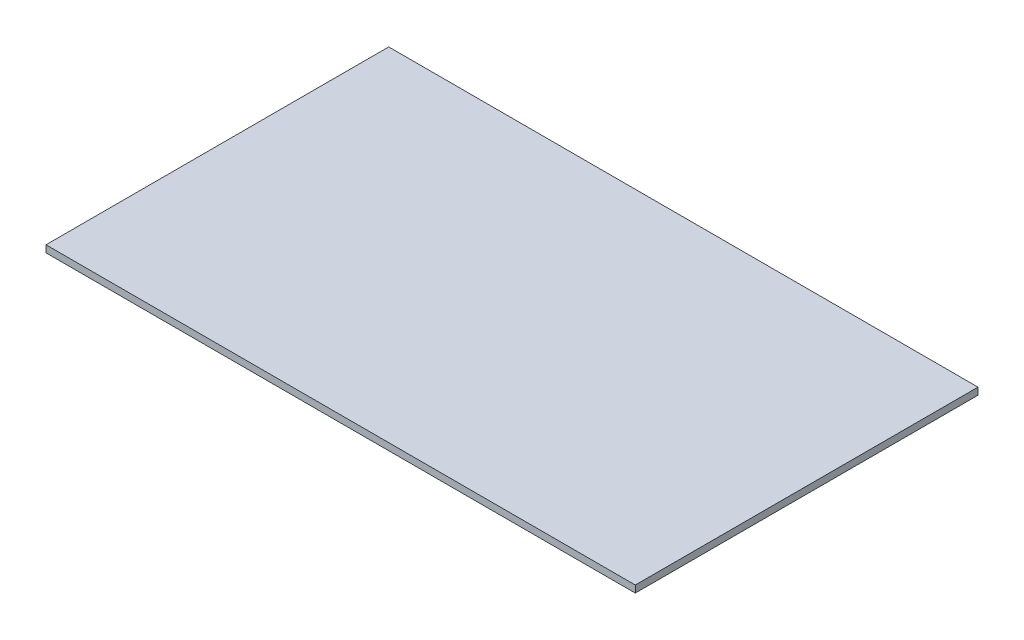
ISO-10303-21;
HEADER;
FILE_DESCRIPTION(('STEP AP214'),'2;1');
FILE_NAME('part.step','',(''),(''),'','','');
FILE_SCHEMA(('AUTOMOTIVE_DESIGN { 1 0 10303 214 1 1 1 1 }'));
ENDSEC;
DATA;
#1=APPLICATION_CONTEXT('core data for automotive mechanical design processes');
#2=APPLICATION_PROTOCOL_DEFINITION('international standard','automotive_design',2000,#1);
#3=PRODUCT_CONTEXT('',#1,'mechanical');
#4=PRODUCT('Part','Part','',(#3));
#5=PRODUCT_RELATED_PRODUCT_CATEGORY('part','',(#4));
#6=PRODUCT_DEFINITION_FORMATION('','',#4);
#7=PRODUCT_DEFINITION_CONTEXT('part definition',#1,'design');
#8=PRODUCT_DEFINITION('design','',#6,#7);
#9=PRODUCT_DEFINITION_SHAPE('','',#8);
#10=(LENGTH_UNIT() NAMED_UNIT(*) SI_UNIT(.MILLI.,.METRE.));
#11=(NAMED_UNIT(*) PLANE_ANGLE_UNIT() SI_UNIT($,.RADIAN.));
#12=(NAMED_UNIT(*) SI_UNIT($,.STERADIAN.) SOLID_ANGLE_UNIT());
#13=UNCERTAINTY_MEASURE_WITH_UNIT(LENGTH_MEASURE(1.E-05),#10,'distance_accuracy_value','');
#14=(GEOMETRIC_REPRESENTATION_CONTEXT(3) GLOBAL_UNCERTAINTY_ASSIGNED_CONTEXT((#13)) GLOBAL_UNIT_ASSIGNED_CONTEXT((#10,
#11,#12)) REPRESENTATION_CONTEXT('',''));
#15=CARTESIAN_POINT('',(0.,0.,0.));
#16=DIRECTION('',(0.,0.,1.));
#17=DIRECTION('',(1.,0.,0.));
#18=AXIS2_PLACEMENT_3D('',#15,#16,#17);
#19=CARTESIAN_POINT('',(-146.312791178337,3.,73.5829634934783));
#20=DIRECTION('',(1.,0.,0.));
#21=DIRECTION('',(0.,0.,-1.));
#22=AXIS2_PLACEMENT_3D('',#19,#20,#21);
#23=PLANE('',#22);
#24=DIRECTION('',(0.,0.,1.));
#25=VECTOR('',#24,1.);
#26=CARTESIAN_POINT('',(-146.312791178337,0.,73.5829634934783));
#27=LINE('',#26,#25);
#28=CARTESIAN_POINT('',(-146.312791178337,0.,-73.1563955891683));
#29=VERTEX_POINT('',#28);
#30=CARTESIAN_POINT('',(-146.312791178337,0.,73.5829634934783));
#31=VERTEX_POINT('',#30);
#32=EDGE_CURVE('E95',#29,#31,#27,.T.);
#33=ORIENTED_EDGE('',*,*,#32,.T.);
#34=DIRECTION('',(0.,-1.,0.));
#35=VECTOR('',#34,1.);
#36=CARTESIAN_POINT('',(-146.312791178337,3.,73.5829634934783));
#37=LINE('',#36,#35);
#38=CARTESIAN_POINT('',(-146.312791178337,3.,73.5829634934783));
#39=VERTEX_POINT('',#38);
#40=EDGE_CURVE('E11',#39,#31,#37,.T.);
#41=ORIENTED_EDGE('',*,*,#40,.F.);
#42=DIRECTION('',(0.,0.,1.));
#43=VECTOR('',#42,1.);
#44=CARTESIAN_POINT('',(-146.312791178337,3.,73.5829634934783));
#45=LINE('',#44,#43);
#46=CARTESIAN_POINT('',(-146.312791178337,3.,-73.1563955891683));
#47=VERTEX_POINT('',#46);
#48=EDGE_CURVE('E83',#47,#39,#45,.T.);
#49=ORIENTED_EDGE('',*,*,#48,.F.);
#50=DIRECTION('',(0.,-1.,0.));
#51=VECTOR('',#50,1.);
#52=CARTESIAN_POINT('',(-146.312791178337,3.,-73.1563955891683));
#53=LINE('',#52,#51);
#54=EDGE_CURVE('E91',#47,#29,#53,.T.);
#55=ORIENTED_EDGE('',*,*,#54,.T.);
#56=EDGE_LOOP('',(#33,#41,#49,#55));
#57=FACE_BOUND('',#56,.T.);
#58=ADVANCED_FACE('F32',(#57),#23,.F.);
#59=CARTESIAN_POINT('',(-146.312791178337,3.,73.5829634934783));
#60=DIRECTION('',(0.,0.,-1.));
#61=DIRECTION('',(-1.,0.,0.));
#62=AXIS2_PLACEMENT_3D('',#59,#60,#61);
#63=PLANE('',#62);
#64=DIRECTION('',(1.,0.,0.));
#65=VECTOR('',#64,1.);
#66=CARTESIAN_POINT('',(-146.312791178337,0.,73.5829634934783));
#67=LINE('',#66,#65);
#68=CARTESIAN_POINT('',(106.00212422104,0.,73.5829634934783));
#69=VERTEX_POINT('',#68);
#70=EDGE_CURVE('E87',#31,#69,#67,.T.);
#71=ORIENTED_EDGE('',*,*,#70,.T.);
#72=DIRECTION('',(0.,-1.,0.));
#73=VECTOR('',#72,1.);
#74=CARTESIAN_POINT('',(106.00212422104,3.,73.5829634934783));
#75=LINE('',#74,#73);
#76=CARTESIAN_POINT('',(106.00212422104,3.,73.5829634934783));
#77=VERTEX_POINT('',#76);
#78=EDGE_CURVE('E40',#77,#69,#75,.T.);
#79=ORIENTED_EDGE('',*,*,#78,.F.);
#80=DIRECTION('',(1.,0.,0.));
#81=VECTOR('',#80,1.);
#82=CARTESIAN_POINT('',(-146.312791178337,3.,73.5829634934783));
#83=LINE('',#82,#81);
#84=EDGE_CURVE('E78',#39,#77,#83,.T.);
#85=ORIENTED_EDGE('',*,*,#84,.F.);
#86=ORIENTED_EDGE('',*,*,#40,.T.);
#87=EDGE_LOOP('',(#71,#79,#85,#86));
#88=FACE_BOUND('',#87,.T.);
#89=ADVANCED_FACE('F86',(#88),#63,.F.);
#90=CARTESIAN_POINT('',(106.00212422104,3.,73.5829634934783));
#91=DIRECTION('',(-1.,0.,0.));
#92=DIRECTION('',(0.,0.,1.));
#93=AXIS2_PLACEMENT_3D('',#90,#91,#92);
#94=PLANE('',#93);
#95=DIRECTION('',(0.,0.,-1.));
#96=VECTOR('',#95,1.);
#97=CARTESIAN_POINT('',(106.00212422104,0.,73.5829634934783));
#98=LINE('',#97,#96);
#99=CARTESIAN_POINT('',(106.00212422104,0.,-73.1563955891683));
#100=VERTEX_POINT('',#99);
#101=EDGE_CURVE('E65',#69,#100,#98,.T.);
#102=ORIENTED_EDGE('',*,*,#101,.T.);
#103=DIRECTION('',(0.,-1.,0.));
#104=VECTOR('',#103,1.);
#105=CARTESIAN_POINT('',(106.00212422104,3.,-73.1563955891683));
#106=LINE('',#105,#104);
#107=CARTESIAN_POINT('',(106.00212422104,3.,-73.1563955891683));
#108=VERTEX_POINT('',#107);
#109=EDGE_CURVE('E88',#108,#100,#106,.T.);
#110=ORIENTED_EDGE('',*,*,#109,.F.);
#111=DIRECTION('',(0.,0.,-1.));
#112=VECTOR('',#111,1.);
#113=CARTESIAN_POINT('',(106.00212422104,3.,73.5829634934783));
#114=LINE('',#113,#112);
#115=EDGE_CURVE('E81',#77,#108,#114,.T.);
#116=ORIENTED_EDGE('',*,*,#115,.F.);
#117=ORIENTED_EDGE('',*,*,#78,.T.);
#118=EDGE_LOOP('',(#102,#110,#116,#117));
#119=FACE_BOUND('',#118,.T.);
#120=ADVANCED_FACE('F89',(#119),#94,.F.);
#121=CARTESIAN_POINT('',(-146.312791178337,3.,-73.1563955891683));
#122=DIRECTION('',(0.,0.,1.));
#123=DIRECTION('',(1.,0.,0.));
#124=AXIS2_PLACEMENT_3D('',#121,#122,#123);
#125=PLANE('',#124);
#126=DIRECTION('',(-1.,0.,0.));
#127=VECTOR('',#126,1.);
#128=CARTESIAN_POINT('',(-146.312791178337,0.,-73.1563955891683));
#129=LINE('',#128,#127);
#130=EDGE_CURVE('E71',#100,#29,#129,.T.);
#131=ORIENTED_EDGE('',*,*,#130,.T.);
#132=ORIENTED_EDGE('',*,*,#54,.F.);
#133=DIRECTION('',(-1.,0.,0.));
#134=VECTOR('',#133,1.);
#135=CARTESIAN_POINT('',(-146.312791178337,3.,-73.1563955891683));
#136=LINE('',#135,#134);
#137=EDGE_CURVE('E48',#108,#47,#136,.T.);
#138=ORIENTED_EDGE('',*,*,#137,.F.);
#139=ORIENTED_EDGE('',*,*,#109,.T.);
#140=EDGE_LOOP('',(#131,#132,#138,#139));
#141=FACE_BOUND('',#140,.T.);
#142=ADVANCED_FACE('F102',(#141),#125,.F.);
#143=CARTESIAN_POINT('',(0.,3.,0.));
#144=DIRECTION('',(0.,-1.,0.));
#145=DIRECTION('',(0.,0.,-1.));
#146=AXIS2_PLACEMENT_3D('',#143,#144,#145);
#147=PLANE('',#146);
#148=ORIENTED_EDGE('',*,*,#48,.T.);
#149=ORIENTED_EDGE('',*,*,#84,.T.);
#150=ORIENTED_EDGE('',*,*,#115,.T.);
#151=ORIENTED_EDGE('',*,*,#137,.T.);
#152=EDGE_LOOP('',(#148,#149,#150,#151));
#153=FACE_BOUND('',#152,.T.);
#154=ADVANCED_FACE('F79',(#153),#147,.F.);
#155=CARTESIAN_POINT('',(0.,0.,0.));
#156=DIRECTION('',(0.,-1.,0.));
#157=DIRECTION('',(0.,0.,-1.));
#158=AXIS2_PLACEMENT_3D('',#155,#156,#157);
#159=PLANE('',#158);
#160=ORIENTED_EDGE('',*,*,#32,.F.);
#161=ORIENTED_EDGE('',*,*,#130,.F.);
#162=ORIENTED_EDGE('',*,*,#101,.F.);
#163=ORIENTED_EDGE('',*,*,#70,.F.);
#164=EDGE_LOOP('',(#160,#161,#162,#163));
#165=FACE_BOUND('',#164,.T.);
#166=ADVANCED_FACE('F105',(#165),#159,.T.);
#167=CLOSED_SHELL('',(#58,#89,#120,#142,#154,#166));
#168=MANIFOLD_SOLID_BREP('B2',#167);
#169=ADVANCED_BREP_SHAPE_REPRESENTATION('',(#18,#168),#14);
#170=SHAPE_DEFINITION_REPRESENTATION(#9,#169);
ENDSEC;
END-ISO-10303-21;
